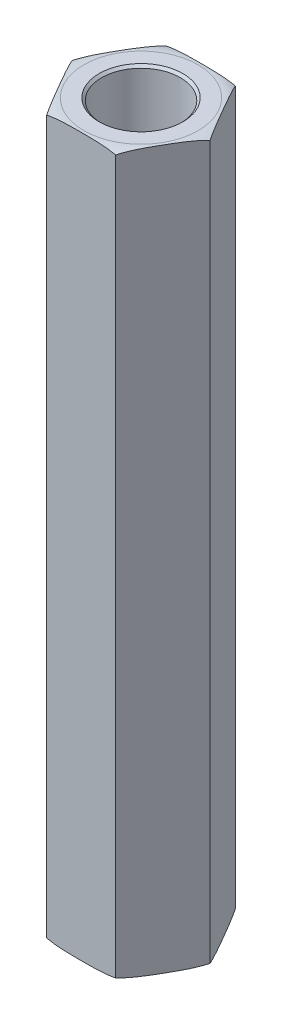
ISO-10303-21;
HEADER;
FILE_DESCRIPTION(('STEP AP214'),'2;1');
FILE_NAME('part.step','',(''),(''),'','','');
FILE_SCHEMA(('AUTOMOTIVE_DESIGN { 1 0 10303 214 1 1 1 1 }'));
ENDSEC;
DATA;
#1=APPLICATION_CONTEXT('core data for automotive mechanical design processes');
#2=APPLICATION_PROTOCOL_DEFINITION('international standard','automotive_design',2000,#1);
#3=PRODUCT_CONTEXT('',#1,'mechanical');
#4=PRODUCT('Part','Part','',(#3));
#5=PRODUCT_RELATED_PRODUCT_CATEGORY('part','',(#4));
#6=PRODUCT_DEFINITION_FORMATION('','',#4);
#7=PRODUCT_DEFINITION_CONTEXT('part definition',#1,'design');
#8=PRODUCT_DEFINITION('design','',#6,#7);
#9=PRODUCT_DEFINITION_SHAPE('','',#8);
#10=(LENGTH_UNIT() NAMED_UNIT(*) SI_UNIT(.MILLI.,.METRE.));
#11=(NAMED_UNIT(*) PLANE_ANGLE_UNIT() SI_UNIT($,.RADIAN.));
#12=(NAMED_UNIT(*) SI_UNIT($,.STERADIAN.) SOLID_ANGLE_UNIT());
#13=UNCERTAINTY_MEASURE_WITH_UNIT(LENGTH_MEASURE(1.E-05),#10,'distance_accuracy_value','');
#14=(GEOMETRIC_REPRESENTATION_CONTEXT(3) GLOBAL_UNCERTAINTY_ASSIGNED_CONTEXT((#13)) GLOBAL_UNIT_ASSIGNED_CONTEXT((#10,
#11,#12)) REPRESENTATION_CONTEXT('',''));
#15=CARTESIAN_POINT('',(0.,0.,0.));
#16=DIRECTION('',(0.,0.,1.));
#17=DIRECTION('',(1.,0.,0.));
#18=AXIS2_PLACEMENT_3D('',#15,#16,#17);
#19=CARTESIAN_POINT('',(0.,6.35,0.));
#20=DIRECTION('',(0.,1.,0.));
#21=DIRECTION('',(0.,0.,1.));
#22=AXIS2_PLACEMENT_3D('',#19,#20,#21);
#23=PLANE('',#22);
#24=CARTESIAN_POINT('',(0.,6.35,0.));
#25=DIRECTION('',(0.,1.,0.));
#26=DIRECTION('',(0.,0.,1.));
#27=AXIS2_PLACEMENT_3D('',#24,#25,#26);
#28=CIRCLE('',#27,2.0955);
#29=CARTESIAN_POINT('',(0.,6.35,2.0955));
#30=VERTEX_POINT('',#29);
#31=EDGE_CURVE('E438',#30,#30,#28,.T.);
#32=ORIENTED_EDGE('',*,*,#31,.T.);
#33=EDGE_LOOP('',(#32));
#34=FACE_BOUND('',#33,.T.);
#35=ADVANCED_FACE('F18',(#34),#23,.T.);
#36=CARTESIAN_POINT('',(0.,-6.35,0.));
#37=DIRECTION('',(0.,-1.,0.));
#38=DIRECTION('',(0.,0.,-1.));
#39=AXIS2_PLACEMENT_3D('',#36,#37,#38);
#40=PLANE('',#39);
#41=CARTESIAN_POINT('',(0.,-6.35,0.));
#42=DIRECTION('',(0.,-1.,0.));
#43=DIRECTION('',(0.,0.,-1.));
#44=AXIS2_PLACEMENT_3D('',#41,#42,#43);
#45=CIRCLE('',#44,2.0955);
#46=CARTESIAN_POINT('',(0.,-6.35,-2.0955));
#47=VERTEX_POINT('',#46);
#48=EDGE_CURVE('E131',#47,#47,#45,.T.);
#49=ORIENTED_EDGE('',*,*,#48,.T.);
#50=EDGE_LOOP('',(#49));
#51=FACE_BOUND('',#50,.T.);
#52=ADVANCED_FACE('F406',(#51),#40,.T.);
#53=CARTESIAN_POINT('',(0.,6.35,0.));
#54=DIRECTION('',(0.,1.,0.));
#55=DIRECTION('',(0.,0.,1.));
#56=AXIS2_PLACEMENT_3D('',#53,#54,#55);
#57=CYLINDRICAL_SURFACE('',#56,2.0955);
#58=CARTESIAN_POINT('',(0.,18.9229999999725,0.));
#59=DIRECTION('',(0.,1.,0.));
#60=DIRECTION('',(0.,0.,1.));
#61=AXIS2_PLACEMENT_3D('',#58,#59,#60);
#62=CIRCLE('',#61,2.09549999999581);
#63=CARTESIAN_POINT('',(0.,18.9229999999725,2.09549999999581));
#64=VERTEX_POINT('',#63);
#65=EDGE_CURVE('E129',#64,#64,#62,.T.);
#66=ORIENTED_EDGE('',*,*,#65,.T.);
#67=EDGE_LOOP('',(#66));
#68=FACE_BOUND('',#67,.T.);
#69=ORIENTED_EDGE('',*,*,#31,.F.);
#70=EDGE_LOOP('',(#69));
#71=FACE_BOUND('',#70,.T.);
#72=ADVANCED_FACE('F397',(#68,#71),#57,.F.);
#73=CARTESIAN_POINT('',(0.,-6.35,0.));
#74=DIRECTION('',(0.,-1.,0.));
#75=DIRECTION('',(0.,0.,-1.));
#76=AXIS2_PLACEMENT_3D('',#73,#74,#75);
#77=CYLINDRICAL_SURFACE('',#76,2.0955);
#78=ORIENTED_EDGE('',*,*,#48,.F.);
#79=EDGE_LOOP('',(#78));
#80=FACE_BOUND('',#79,.T.);
#81=CARTESIAN_POINT('',(0.,-18.9229999999725,0.));
#82=DIRECTION('',(0.,-1.,0.));
#83=DIRECTION('',(0.,0.,-1.));
#84=AXIS2_PLACEMENT_3D('',#81,#82,#83);
#85=CIRCLE('',#84,2.09550000005265);
#86=CARTESIAN_POINT('',(0.,-18.9229999999725,-2.09550000005265));
#87=VERTEX_POINT('',#86);
#88=EDGE_CURVE('E94',#87,#87,#85,.T.);
#89=ORIENTED_EDGE('',*,*,#88,.T.);
#90=EDGE_LOOP('',(#89));
#91=FACE_BOUND('',#90,.T.);
#92=ADVANCED_FACE('F388',(#80,#91),#77,.F.);
#93=CARTESIAN_POINT('',(0.,19.0499999999361,0.));
#94=DIRECTION('',(0.,1.,0.));
#95=DIRECTION('',(0.,0.,1.));
#96=AXIS2_PLACEMENT_3D('',#93,#94,#95);
#97=CONICAL_SURFACE('',#96,2.22249999995938,0.785398163397448);
#98=CARTESIAN_POINT('',(0.,19.0499999999929,0.));
#99=DIRECTION('',(0.,1.,0.));
#100=DIRECTION('',(0.,0.,1.));
#101=AXIS2_PLACEMENT_3D('',#98,#99,#100);
#102=CIRCLE('',#101,2.22250000001623);
#103=CARTESIAN_POINT('',(0.,19.0499999999929,2.22250000001623));
#104=VERTEX_POINT('',#103);
#105=EDGE_CURVE('E206',#104,#104,#102,.T.);
#106=ORIENTED_EDGE('',*,*,#105,.T.);
#107=EDGE_LOOP('',(#106));
#108=FACE_BOUND('',#107,.T.);
#109=ORIENTED_EDGE('',*,*,#65,.F.);
#110=EDGE_LOOP('',(#109));
#111=FACE_BOUND('',#110,.T.);
#112=ADVANCED_FACE('F380',(#108,#111),#97,.F.);
#113=CARTESIAN_POINT('',(0.,-19.0499999999361,0.));
#114=DIRECTION('',(0.,-1.,0.));
#115=DIRECTION('',(0.,0.,-1.));
#116=AXIS2_PLACEMENT_3D('',#113,#114,#115);
#117=CONICAL_SURFACE('',#116,2.22250000001623,0.785398163397448);
#118=ORIENTED_EDGE('',*,*,#88,.F.);
#119=EDGE_LOOP('',(#118));
#120=FACE_BOUND('',#119,.T.);
#121=CARTESIAN_POINT('',(0.,-19.0499999999361,0.));
#122=DIRECTION('',(0.,-1.,0.));
#123=DIRECTION('',(0.,0.,-1.));
#124=AXIS2_PLACEMENT_3D('',#121,#122,#123);
#125=CIRCLE('',#124,2.22250000001623);
#126=CARTESIAN_POINT('',(0.,-19.0499999999361,-2.22250000001623));
#127=VERTEX_POINT('',#126);
#128=EDGE_CURVE('E201',#127,#127,#125,.F.);
#129=ORIENTED_EDGE('',*,*,#128,.F.);
#130=EDGE_LOOP('',(#129));
#131=FACE_BOUND('',#130,.T.);
#132=ADVANCED_FACE('F373',(#120,#131),#117,.F.);
#133=CARTESIAN_POINT('',(1.83308710467706,19.05,3.17499999999999));
#134=DIRECTION('',(-0.866025403784439,0.,-0.5));
#135=DIRECTION('',(-0.5,0.,0.866025403784439));
#136=AXIS2_PLACEMENT_3D('',#133,#134,#135);
#137=PLANE('',#136);
#138=DIRECTION('',(0.,1.,0.));
#139=VECTOR('',#138,1.);
#140=CARTESIAN_POINT('',(3.66617420935412,19.05,0.));
#141=LINE('',#140,#139);
#142=CARTESIAN_POINT('',(3.66617420935412,-18.923,0.));
#143=VERTEX_POINT('',#142);
#144=CARTESIAN_POINT('',(3.66617420935412,18.923,0.));
#145=VERTEX_POINT('',#144);
#146=EDGE_CURVE('E76',#143,#145,#141,.T.);
#147=ORIENTED_EDGE('',*,*,#146,.T.);
#148=CARTESIAN_POINT('',(1.83308710467706,18.923,3.17499999999999));
#149=CARTESIAN_POINT('',(1.87128169935724,18.9389014148997,3.10884502143943));
#150=CARTESIAN_POINT('',(1.90969320538962,18.9524886076105,3.04231434139611));
#151=CARTESIAN_POINT('',(1.98677079607408,18.9758161979402,2.90881203820562));
#152=CARTESIAN_POINT('',(2.02543658353273,18.9855604771397,2.84184092981258));
#153=CARTESIAN_POINT('',(2.10284499535247,19.0019966530451,2.70776562760758));
#154=CARTESIAN_POINT('',(2.14158731769808,19.0086945328669,2.64066195690178));
#155=CARTESIAN_POINT('',(2.21916296783007,19.0197767572932,2.50629698944297));
#156=CARTESIAN_POINT('',(2.2579963181535,19.024160450474,2.43903565365468));
#157=CARTESIAN_POINT('',(2.33572065438806,19.0312403004263,2.30441315431184));
#158=CARTESIAN_POINT('',(2.37461166028646,19.0339355237591,2.23705195613837));
#159=CARTESIAN_POINT('',(2.45240986808529,19.0381531983713,2.10230150749298));
#160=CARTESIAN_POINT('',(2.49131707051153,19.0396756080272,2.03491225611037));
#161=CARTESIAN_POINT('',(2.5687461380425,19.041922705889,1.90080117716405));
#162=CARTESIAN_POINT('',(2.60726795154189,19.0426552468181,1.83407943898342));
#163=CARTESIAN_POINT('',(2.6843135305698,19.0435767302574,1.70063258160851));
#164=CARTESIAN_POINT('',(2.72283729611684,19.0437656658949,1.63390746238215));
#165=CARTESIAN_POINT('',(2.79990166972112,19.0436659966806,1.50042805184608));
#166=CARTESIAN_POINT('',(2.83844227771303,19.0433771811766,1.4336737606495));
#167=CARTESIAN_POINT('',(2.91552223317795,19.042221986219,1.30016736153911));
#168=CARTESIAN_POINT('',(2.9540615806188,19.0413555970386,1.23341525368101));
#169=CARTESIAN_POINT('',(3.03113161773355,19.0387861940656,1.09992603365704));
#170=CARTESIAN_POINT('',(3.06966230777161,19.0370832271617,1.03318892086044));
#171=CARTESIAN_POINT('',(3.14670480062218,19.0324387229726,0.899747408901487));
#172=CARTESIAN_POINT('',(3.18521660427684,19.0294972471358,0.833043008280498));
#173=CARTESIAN_POINT('',(3.24841925163182,19.0232174124749,0.72357281188882));
#174=CARTESIAN_POINT('',(3.27312282066116,19.0203980110463,0.680784975201713));
#175=CARTESIAN_POINT('',(3.32249186130897,19.0138696794304,0.595275288478771));
#176=CARTESIAN_POINT('',(3.34715734368941,19.0101610809139,0.552553419802656));
#177=CARTESIAN_POINT('',(3.39643377591427,19.0016802711497,0.467204135573464));
#178=CARTESIAN_POINT('',(3.42104474295594,18.9969084657008,0.424576690233898));
#179=CARTESIAN_POINT('',(3.47026036719572,18.9860987712516,0.339332728524376));
#180=CARTESIAN_POINT('',(3.49486485317658,18.9800577313084,0.296716508711413));
#181=CARTESIAN_POINT('',(3.54398805502187,18.9665138354161,0.21163262728491));
#182=CARTESIAN_POINT('',(3.56850671785506,18.959010197803,0.169165057524178));
#183=CARTESIAN_POINT('',(3.61743974029948,18.9423203507084,0.0844105764825355));
#184=CARTESIAN_POINT('',(3.64185387349849,18.9331314978033,0.0421240573590955));
#185=CARTESIAN_POINT('',(3.66617420935412,18.923,0.));
#186=B_SPLINE_CURVE_WITH_KNOTS('',3,(#148,#149,#150,#151,#152,#153,#154,#155,#156,#157,#158,
#159,#160,#161,#162,#163,#164,#165,#166,#167,#168,#169,#170,#171,#172,#173,#174,#175,#176,#177,
#178,#179,#180,#181,#182,#183,#184,#185),.UNSPECIFIED.,.F.,.F.,(4,2,2,2,2,2,2,2,2,2,2,2,2,2,2,2,
2,2,4),(0.,0.233977307817955,0.46771767504072,0.700996973557539,0.934341903229802,
1.16781571967246,1.40129782179832,1.63243665809679,1.86357841666627,2.09482211846306,
2.32606971471508,2.55730435147412,2.78852751694429,2.936983692651,3.08538458004484,
3.23372892334592,3.38244598546617,3.53124274626086,3.68027493713584),.UNSPECIFIED.);
#187=CARTESIAN_POINT('',(1.83308710467706,18.923,3.17499999999999));
#188=VERTEX_POINT('',#187);
#189=EDGE_CURVE('E100',#188,#145,#186,.T.);
#190=ORIENTED_EDGE('',*,*,#189,.F.);
#191=DIRECTION('',(0.,1.,0.));
#192=VECTOR('',#191,1.);
#193=CARTESIAN_POINT('',(1.83308710467707,19.05,3.17499999999999));
#194=LINE('',#193,#192);
#195=CARTESIAN_POINT('',(1.83308710467706,-18.923,3.17499999999999));
#196=VERTEX_POINT('',#195);
#197=EDGE_CURVE('E93',#188,#196,#194,.F.);
#198=ORIENTED_EDGE('',*,*,#197,.T.);
#199=CARTESIAN_POINT('',(3.66617420935412,-18.923,0.));
#200=CARTESIAN_POINT('',(3.62797961467394,-18.9389014148997,0.0661549785605664));
#201=CARTESIAN_POINT('',(3.58956810864156,-18.9524886076105,0.132685658603887));
#202=CARTESIAN_POINT('',(3.5124905179571,-18.9758161979402,0.266187961794378));
#203=CARTESIAN_POINT('',(3.47382473049845,-18.9855604771397,0.333159070187413));
#204=CARTESIAN_POINT('',(3.39641631867871,-19.0019966530451,0.467234372392412));
#205=CARTESIAN_POINT('',(3.3576739963331,-19.0086945328669,0.53433804309822));
#206=CARTESIAN_POINT('',(3.28009834620111,-19.0197767572932,0.668703010557026));
#207=CARTESIAN_POINT('',(3.24126499587768,-19.024160450474,0.735964346345317));
#208=CARTESIAN_POINT('',(3.16354065964312,-19.0312403004263,0.870586845688155));
#209=CARTESIAN_POINT('',(3.12464965374472,-19.0339355237591,0.937948043861631));
#210=CARTESIAN_POINT('',(3.04685144594589,-19.0381531983713,1.07269849250702));
#211=CARTESIAN_POINT('',(3.00794424351965,-19.0396756080272,1.14008774388963));
#212=CARTESIAN_POINT('',(2.93051517598868,-19.041922705889,1.27419882283594));
#213=CARTESIAN_POINT('',(2.89199336248929,-19.0426552468181,1.34092056101658));
#214=CARTESIAN_POINT('',(2.81494778346138,-19.0435767302574,1.47436741839149));
#215=CARTESIAN_POINT('',(2.77642401791434,-19.0437656658949,1.54109253761784));
#216=CARTESIAN_POINT('',(2.69935964431006,-19.0436659966806,1.67457194815391));
#217=CARTESIAN_POINT('',(2.66081903631815,-19.0433771811766,1.7413262393505));
#218=CARTESIAN_POINT('',(2.58373908085323,-19.042221986219,1.87483263846089));
#219=CARTESIAN_POINT('',(2.54519973341238,-19.0413555970386,1.94158474631899));
#220=CARTESIAN_POINT('',(2.46812969629763,-19.0387861940656,2.07507396634296));
#221=CARTESIAN_POINT('',(2.42959900625957,-19.0370832271617,2.14181107913956));
#222=CARTESIAN_POINT('',(2.352556513409,-19.0324387229726,2.27525259109851));
#223=CARTESIAN_POINT('',(2.31404470975434,-19.0294972471358,2.3419569917195));
#224=CARTESIAN_POINT('',(2.25084206239936,-19.0232174124749,2.45142718811118));
#225=CARTESIAN_POINT('',(2.22613849337002,-19.0203980110463,2.49421502479828));
#226=CARTESIAN_POINT('',(2.17676945272221,-19.0138696794304,2.57972471152123));
#227=CARTESIAN_POINT('',(2.15210397034177,-19.0101610809139,2.62244658019734));
#228=CARTESIAN_POINT('',(2.10282753811691,-19.0016802711497,2.70779586442653));
#229=CARTESIAN_POINT('',(2.07821657107524,-18.9969084657008,2.7504233097661));
#230=CARTESIAN_POINT('',(2.02900094683546,-18.9860987712516,2.83566727147562));
#231=CARTESIAN_POINT('',(2.0043964608546,-18.9800577313084,2.87828349128858));
#232=CARTESIAN_POINT('',(1.95527325900931,-18.9665138354161,2.96336737271509));
#233=CARTESIAN_POINT('',(1.93075459617612,-18.959010197803,3.00583494247582));
#234=CARTESIAN_POINT('',(1.88182157373171,-18.9423203507084,3.09058942351746));
#235=CARTESIAN_POINT('',(1.8574074405327,-18.9331314978033,3.1328759426409));
#236=CARTESIAN_POINT('',(1.83308710467706,-18.923,3.17499999999999));
#237=B_SPLINE_CURVE_WITH_KNOTS('',3,(#199,#200,#201,#202,#203,#204,#205,#206,#207,#208,#209,
#210,#211,#212,#213,#214,#215,#216,#217,#218,#219,#220,#221,#222,#223,#224,#225,#226,#227,#228,
#229,#230,#231,#232,#233,#234,#235,#236),.UNSPECIFIED.,.F.,.F.,(4,2,2,2,2,2,2,2,2,2,2,2,2,2,2,2,
2,2,4),(0.,0.233977307817955,0.46771767504072,0.70099697355754,0.934341903229803,
1.16781571967246,1.40129782179833,1.63243665809679,1.86357841666628,2.09482211846306,
2.32606971471508,2.55730435147412,2.78852751694429,2.93698369265101,3.08538458004484,
3.23372892334592,3.38244598546617,3.53124274626086,3.68027493713584),.UNSPECIFIED.);
#238=EDGE_CURVE('E87',#143,#196,#237,.T.);
#239=ORIENTED_EDGE('',*,*,#238,.F.);
#240=EDGE_LOOP('',(#147,#190,#198,#239));
#241=FACE_BOUND('',#240,.T.);
#242=ADVANCED_FACE('F91',(#241),#137,.F.);
#243=CARTESIAN_POINT('',(3.66617420935412,19.05,0.));
#244=DIRECTION('',(-0.866025403784439,0.,0.5));
#245=DIRECTION('',(0.5,0.,0.866025403784439));
#246=AXIS2_PLACEMENT_3D('',#243,#244,#245);
#247=PLANE('',#246);
#248=DIRECTION('',(0.,1.,0.));
#249=VECTOR('',#248,1.);
#250=CARTESIAN_POINT('',(1.83308710467706,19.05,-3.175));
#251=LINE('',#250,#249);
#252=CARTESIAN_POINT('',(1.83308710467706,-18.923,-3.175));
#253=VERTEX_POINT('',#252);
#254=CARTESIAN_POINT('',(1.83308710467705,18.923,-3.175));
#255=VERTEX_POINT('',#254);
#256=EDGE_CURVE('E165',#253,#255,#251,.T.);
#257=ORIENTED_EDGE('',*,*,#256,.T.);
#258=CARTESIAN_POINT('',(3.66617420935412,18.923,0.));
#259=CARTESIAN_POINT('',(3.62797961467394,18.9389014148997,-0.0661549785605604));
#260=CARTESIAN_POINT('',(3.58956810864156,18.9524886076105,-0.132685658603881));
#261=CARTESIAN_POINT('',(3.5124905179571,18.9758161979402,-0.266187961794372));
#262=CARTESIAN_POINT('',(3.47382473049845,18.9855604771397,-0.333159070187407));
#263=CARTESIAN_POINT('',(3.39641631867872,19.0019966530451,-0.467234372392405));
#264=CARTESIAN_POINT('',(3.35767399633311,19.0086945328669,-0.534338043098212));
#265=CARTESIAN_POINT('',(3.28009834620111,19.0197767572932,-0.668703010557018));
#266=CARTESIAN_POINT('',(3.24126499587769,19.024160450474,-0.735964346345308));
#267=CARTESIAN_POINT('',(3.16354065964312,19.0312403004263,-0.870586845688146));
#268=CARTESIAN_POINT('',(3.12464965374473,19.0339355237591,-0.937948043861621));
#269=CARTESIAN_POINT('',(3.04685144594589,19.0381531983713,-1.07269849250701));
#270=CARTESIAN_POINT('',(3.00794424351965,19.0396756080272,-1.14008774388962));
#271=CARTESIAN_POINT('',(2.93051517598869,19.041922705889,-1.27419882283593));
#272=CARTESIAN_POINT('',(2.8919933624893,19.0426552468181,-1.34092056101657));
#273=CARTESIAN_POINT('',(2.81494778346139,19.0435767302574,-1.47436741839148));
#274=CARTESIAN_POINT('',(2.77642401791434,19.0437656658949,-1.54109253761783));
#275=CARTESIAN_POINT('',(2.69935964431007,19.0436659966806,-1.6745719481539));
#276=CARTESIAN_POINT('',(2.66081903631816,19.0433771811766,-1.74132623935049));
#277=CARTESIAN_POINT('',(2.58373908085323,19.042221986219,-1.87483263846088));
#278=CARTESIAN_POINT('',(2.54519973341239,19.0413555970386,-1.94158474631897));
#279=CARTESIAN_POINT('',(2.46812969629764,19.0387861940656,-2.07507396634294));
#280=CARTESIAN_POINT('',(2.42959900625958,19.0370832271617,-2.14181107913955));
#281=CARTESIAN_POINT('',(2.35255651340901,19.0324387229726,-2.27525259109849));
#282=CARTESIAN_POINT('',(2.31404470975435,19.0294972471358,-2.34195699171948));
#283=CARTESIAN_POINT('',(2.25084206239937,19.0232174124749,-2.45142718811116));
#284=CARTESIAN_POINT('',(2.22613849337003,19.0203980110463,-2.49421502479827));
#285=CARTESIAN_POINT('',(2.17676945272222,19.0138696794304,-2.57972471152122));
#286=CARTESIAN_POINT('',(2.15210397034178,19.0101610809139,-2.62244658019733));
#287=CARTESIAN_POINT('',(2.10282753811691,19.0016802711497,-2.70779586442653));
#288=CARTESIAN_POINT('',(2.07821657107524,18.9969084657008,-2.75042330976609));
#289=CARTESIAN_POINT('',(2.02900094683546,18.9860987712516,-2.83566727147562));
#290=CARTESIAN_POINT('',(2.0043964608546,18.9800577313084,-2.87828349128858));
#291=CARTESIAN_POINT('',(1.95527325900931,18.9665138354161,-2.96336737271509));
#292=CARTESIAN_POINT('',(1.93075459617612,18.959010197803,-3.00583494247582));
#293=CARTESIAN_POINT('',(1.8818215737317,18.9423203507084,-3.09058942351747));
#294=CARTESIAN_POINT('',(1.85740744053269,18.9331314978033,-3.13287594264091));
#295=CARTESIAN_POINT('',(1.83308710467705,18.923,-3.175));
#296=B_SPLINE_CURVE_WITH_KNOTS('',3,(#258,#259,#260,#261,#262,#263,#264,#265,#266,#267,#268,
#269,#270,#271,#272,#273,#274,#275,#276,#277,#278,#279,#280,#281,#282,#283,#284,#285,#286,#287,
#288,#289,#290,#291,#292,#293,#294,#295),.UNSPECIFIED.,.F.,.F.,(4,2,2,2,2,2,2,2,2,2,2,2,2,2,2,2,
2,2,4),(0.,0.233977307817954,0.467717675040719,0.700996973557537,0.934341903229799,
1.16781571967246,1.40129782179832,1.63243665809678,1.86357841666627,2.09482211846305,
2.32606971471507,2.55730435147411,2.78852751694428,2.936983692651,3.08538458004484,
3.23372892334592,3.38244598546618,3.53124274626087,3.68027493713586),.UNSPECIFIED.);
#297=EDGE_CURVE('E84',#145,#255,#296,.T.);
#298=ORIENTED_EDGE('',*,*,#297,.F.);
#299=ORIENTED_EDGE('',*,*,#146,.F.);
#300=CARTESIAN_POINT('',(1.83308710467706,-18.923,-3.175));
#301=CARTESIAN_POINT('',(1.87128169935723,-18.9389014148997,-3.10884502143944));
#302=CARTESIAN_POINT('',(1.90969320538961,-18.9524886076105,-3.04231434139612));
#303=CARTESIAN_POINT('',(1.98677079607408,-18.9758161979402,-2.90881203820563));
#304=CARTESIAN_POINT('',(2.02543658353272,-18.9855604771397,-2.84184092981259));
#305=CARTESIAN_POINT('',(2.10284499535246,-19.0019966530451,-2.70776562760759));
#306=CARTESIAN_POINT('',(2.14158731769807,-19.0086945328669,-2.64066195690179));
#307=CARTESIAN_POINT('',(2.21916296783006,-19.0197767572932,-2.50629698944298));
#308=CARTESIAN_POINT('',(2.25799631815349,-19.024160450474,-2.43903565365469));
#309=CARTESIAN_POINT('',(2.33572065438805,-19.0312403004263,-2.30441315431186));
#310=CARTESIAN_POINT('',(2.37461166028645,-19.0339355237591,-2.23705195613838));
#311=CARTESIAN_POINT('',(2.45240986808528,-19.0381531983713,-2.102301507493));
#312=CARTESIAN_POINT('',(2.49131707051152,-19.0396756080272,-2.03491225611039));
#313=CARTESIAN_POINT('',(2.56874613804248,-19.041922705889,-1.90080117716407));
#314=CARTESIAN_POINT('',(2.60726795154187,-19.0426552468181,-1.83407943898344));
#315=CARTESIAN_POINT('',(2.68431353056979,-19.0435767302574,-1.70063258160853));
#316=CARTESIAN_POINT('',(2.72283729611683,-19.0437656658949,-1.63390746238217));
#317=CARTESIAN_POINT('',(2.7999016697211,-19.0436659966806,-1.50042805184611));
#318=CARTESIAN_POINT('',(2.83844227771302,-19.0433771811766,-1.43367376064952));
#319=CARTESIAN_POINT('',(2.91552223317794,-19.042221986219,-1.30016736153913));
#320=CARTESIAN_POINT('',(2.95406158061878,-19.0413555970386,-1.23341525368103));
#321=CARTESIAN_POINT('',(3.03113161773353,-19.0387861940656,-1.09992603365707));
#322=CARTESIAN_POINT('',(3.06966230777159,-19.0370832271617,-1.03318892086046));
#323=CARTESIAN_POINT('',(3.14670480062216,-19.0324387229726,-0.899747408901513));
#324=CARTESIAN_POINT('',(3.18521660427682,-19.0294972471358,-0.833043008280524));
#325=CARTESIAN_POINT('',(3.2484192516318,-19.0232174124749,-0.723572811888844));
#326=CARTESIAN_POINT('',(3.27312282066114,-19.0203980110463,-0.680784975201736));
#327=CARTESIAN_POINT('',(3.32249186130896,-19.0138696794304,-0.59527528847879));
#328=CARTESIAN_POINT('',(3.3471573436894,-19.0101610809139,-0.552553419802673));
#329=CARTESIAN_POINT('',(3.39643377591426,-19.0016802711497,-0.467204135573478));
#330=CARTESIAN_POINT('',(3.42104474295593,-18.9969084657008,-0.42457669023391));
#331=CARTESIAN_POINT('',(3.47026036719571,-18.9860987712516,-0.339332728524384));
#332=CARTESIAN_POINT('',(3.49486485317657,-18.9800577313084,-0.29671650871142));
#333=CARTESIAN_POINT('',(3.54398805502186,-18.9665138354161,-0.211632627284913));
#334=CARTESIAN_POINT('',(3.56850671785505,-18.959010197803,-0.169165057524178));
#335=CARTESIAN_POINT('',(3.61743974029948,-18.9423203507084,-0.0844105764825321));
#336=CARTESIAN_POINT('',(3.64185387349849,-18.9331314978033,-0.0421240573590899));
#337=CARTESIAN_POINT('',(3.66617420935412,-18.923,0.));
#338=B_SPLINE_CURVE_WITH_KNOTS('',3,(#300,#301,#302,#303,#304,#305,#306,#307,#308,#309,#310,
#311,#312,#313,#314,#315,#316,#317,#318,#319,#320,#321,#322,#323,#324,#325,#326,#327,#328,#329,
#330,#331,#332,#333,#334,#335,#336,#337),.UNSPECIFIED.,.F.,.F.,(4,2,2,2,2,2,2,2,2,2,2,2,2,2,2,2,
2,2,4),(0.,0.233977307817952,0.467717675040715,0.700996973557533,0.934341903229794,
1.16781571967245,1.40129782179831,1.63243665809677,1.86357841666626,2.09482211846304,
2.32606971471506,2.5573043514741,2.78852751694426,2.93698369265099,3.08538458004483,
3.23372892334591,3.38244598546617,3.53124274626087,3.68027493713585),.UNSPECIFIED.);
#339=EDGE_CURVE('E81',#253,#143,#338,.T.);
#340=ORIENTED_EDGE('',*,*,#339,.F.);
#341=EDGE_LOOP('',(#257,#298,#299,#340));
#342=FACE_BOUND('',#341,.T.);
#343=ADVANCED_FACE('F79',(#342),#247,.F.);
#344=CARTESIAN_POINT('',(-1.83308710467707,19.05,-3.175));
#345=DIRECTION('',(0.,-1.,0.));
#346=DIRECTION('',(0.,0.,-1.));
#347=AXIS2_PLACEMENT_3D('',#344,#345,#346);
#348=PLANE('',#347);
#349=CARTESIAN_POINT('',(0.,19.05,0.));
#350=DIRECTION('',(0.,-1.,0.));
#351=DIRECTION('',(0.,0.,1.));
#352=AXIS2_PLACEMENT_3D('',#349,#350,#351);
#353=CIRCLE('',#352,3.03117420935412);
#354=CARTESIAN_POINT('',(0.,19.05,3.03117420935412));
#355=VERTEX_POINT('',#354);
#356=CARTESIAN_POINT('',(0.,19.05,-3.03117420935412));
#357=VERTEX_POINT('',#356);
#358=EDGE_CURVE('E242',#355,#357,#353,.T.);
#359=ORIENTED_EDGE('',*,*,#358,.F.);
#360=CARTESIAN_POINT('',(0.,19.05,0.));
#361=DIRECTION('',(0.,-1.,0.));
#362=DIRECTION('',(0.,0.,-1.));
#363=AXIS2_PLACEMENT_3D('',#360,#361,#362);
#364=CIRCLE('',#363,3.03117420935412);
#365=EDGE_CURVE('E205',#357,#355,#364,.T.);
#366=ORIENTED_EDGE('',*,*,#365,.F.);
#367=EDGE_LOOP('',(#359,#366));
#368=FACE_BOUND('',#367,.T.);
#369=ORIENTED_EDGE('',*,*,#105,.F.);
#370=EDGE_LOOP('',(#369));
#371=FACE_BOUND('',#370,.T.);
#372=ADVANCED_FACE('F213',(#368,#371),#348,.F.);
#373=CARTESIAN_POINT('',(-1.83308710467707,-19.05,-3.175));
#374=DIRECTION('',(0.,-1.,0.));
#375=DIRECTION('',(0.,0.,-1.));
#376=AXIS2_PLACEMENT_3D('',#373,#374,#375);
#377=PLANE('',#376);
#378=CARTESIAN_POINT('',(0.,-19.05,0.));
#379=DIRECTION('',(0.,1.,0.));
#380=DIRECTION('',(0.,0.,1.));
#381=AXIS2_PLACEMENT_3D('',#378,#379,#380);
#382=CIRCLE('',#381,3.03117420935412);
#383=CARTESIAN_POINT('',(0.,-19.05,-3.03117420935412));
#384=VERTEX_POINT('',#383);
#385=CARTESIAN_POINT('',(0.,-19.05,3.03117420935412));
#386=VERTEX_POINT('',#385);
#387=EDGE_CURVE('E204',#384,#386,#382,.F.);
#388=ORIENTED_EDGE('',*,*,#387,.T.);
#389=CARTESIAN_POINT('',(0.,-19.05,0.));
#390=DIRECTION('',(0.,1.,0.));
#391=DIRECTION('',(0.,0.,-1.));
#392=AXIS2_PLACEMENT_3D('',#389,#390,#391);
#393=CIRCLE('',#392,3.03117420935412);
#394=EDGE_CURVE('E269',#384,#386,#393,.T.);
#395=ORIENTED_EDGE('',*,*,#394,.F.);
#396=EDGE_LOOP('',(#388,#395));
#397=FACE_BOUND('',#396,.T.);
#398=ORIENTED_EDGE('',*,*,#128,.T.);
#399=EDGE_LOOP('',(#398));
#400=FACE_BOUND('',#399,.T.);
#401=ADVANCED_FACE('F219',(#397,#400),#377,.T.);
#402=CARTESIAN_POINT('',(-1.83308710467707,19.05,3.175));
#403=DIRECTION('',(0.,0.,-1.));
#404=DIRECTION('',(-1.,0.,0.));
#405=AXIS2_PLACEMENT_3D('',#402,#403,#404);
#406=PLANE('',#405);
#407=ORIENTED_EDGE('',*,*,#197,.F.);
#408=CARTESIAN_POINT('',(-1.83308710467706,18.923,3.175));
#409=CARTESIAN_POINT('',(-1.73237579828683,18.9439400141518,3.175));
#410=CARTESIAN_POINT('',(-1.63096506893486,18.9608853495327,3.175));
#411=CARTESIAN_POINT('',(-1.42767146651469,18.9884971643984,3.175));
#412=CARTESIAN_POINT('',(-1.32579191427254,18.9991875658753,3.175));
#413=CARTESIAN_POINT('',(-1.12177634709138,19.0161280408079,3.175));
#414=CARTESIAN_POINT('',(-1.0196405664338,19.0223812707189,3.175));
#415=CARTESIAN_POINT('',(-0.815663681397376,19.0319028064183,3.175));
#416=CARTESIAN_POINT('',(-0.713823115514574,19.0351834044999,3.175));
#417=CARTESIAN_POINT('',(-0.510018485441651,19.0399454848703,3.175));
#418=CARTESIAN_POINT('',(-0.408054390577977,19.0414254100882,3.175));
#419=CARTESIAN_POINT('',(-0.20406020033787,19.0433146818379,3.175));
#420=CARTESIAN_POINT('',(-0.102030100168935,19.0437234241492,3.175));
#421=CARTESIAN_POINT('',(0.102030100168936,19.0437234241492,3.175));
#422=CARTESIAN_POINT('',(0.204060200337871,19.0433146818379,3.17499999999999));
#423=CARTESIAN_POINT('',(0.408054390577978,19.0414254100882,3.17499999999999));
#424=CARTESIAN_POINT('',(0.510018485441653,19.0399454848703,3.17499999999999));
#425=CARTESIAN_POINT('',(0.713823115514576,19.0351834044999,3.17499999999999));
#426=CARTESIAN_POINT('',(0.815663681397379,19.0319028064183,3.17499999999999));
#427=CARTESIAN_POINT('',(1.0196405664338,19.0223812707189,3.17499999999999));
#428=CARTESIAN_POINT('',(1.12177634709138,19.0161280408079,3.17499999999999));
#429=CARTESIAN_POINT('',(1.32579191427255,18.9991875658753,3.17499999999999));
#430=CARTESIAN_POINT('',(1.4276714665147,18.9884971643984,3.17499999999999));
#431=CARTESIAN_POINT('',(1.63096506893487,18.9608853495327,3.17499999999999));
#432=CARTESIAN_POINT('',(1.73237579828684,18.9439400141518,3.17499999999999));
#433=CARTESIAN_POINT('',(1.83308710467707,18.923,3.17499999999999));
#434=B_SPLINE_CURVE_WITH_KNOTS('',3,(#408,#409,#410,#411,#412,#413,#414,#415,#416,#417,#418,
#419,#420,#421,#422,#423,#424,#425,#426,#427,#428,#429,#430,#431,#432,#433),.UNSPECIFIED.,.F.,
.F.,(4,2,2,2,2,2,2,2,2,2,2,2,4),(0.,0.308333242342808,0.615479423308235,0.92240689113001,
1.2280592962085,1.53397581645216,1.84006485747889,2.14615389850562,2.45207041874928,
2.75772282382777,3.06465029164955,3.37179647261498,3.68012971495778),.UNSPECIFIED.);
#435=CARTESIAN_POINT('',(-1.83308710467706,18.923,3.175));
#436=VERTEX_POINT('',#435);
#437=EDGE_CURVE('E191',#436,#188,#434,.T.);
#438=ORIENTED_EDGE('',*,*,#437,.F.);
#439=DIRECTION('',(0.,1.,0.));
#440=VECTOR('',#439,1.);
#441=CARTESIAN_POINT('',(-1.83308710467707,19.05,3.175));
#442=LINE('',#441,#440);
#443=CARTESIAN_POINT('',(-1.83308710467708,-18.923,3.17499999999999));
#444=VERTEX_POINT('',#443);
#445=EDGE_CURVE('E159',#436,#444,#442,.F.);
#446=ORIENTED_EDGE('',*,*,#445,.T.);
#447=CARTESIAN_POINT('',(1.83308710467706,-18.923,3.17499999999999));
#448=CARTESIAN_POINT('',(1.73237579828684,-18.9439400141518,3.17499999999999));
#449=CARTESIAN_POINT('',(1.63096506893486,-18.9608853495327,3.17499999999999));
#450=CARTESIAN_POINT('',(1.4276714665147,-18.9884971643984,3.17499999999999));
#451=CARTESIAN_POINT('',(1.32579191427254,-18.9991875658753,3.17499999999999));
#452=CARTESIAN_POINT('',(1.12177634709138,-19.0161280408079,3.17499999999999));
#453=CARTESIAN_POINT('',(1.0196405664338,-19.0223812707189,3.17499999999999));
#454=CARTESIAN_POINT('',(0.815663681397379,-19.0319028064183,3.17499999999999));
#455=CARTESIAN_POINT('',(0.713823115514576,-19.0351834044999,3.17499999999999));
#456=CARTESIAN_POINT('',(0.510018485441653,-19.0399454848703,3.17499999999999));
#457=CARTESIAN_POINT('',(0.408054390577978,-19.0414254100882,3.17499999999999));
#458=CARTESIAN_POINT('',(0.204060200337871,-19.0433146818379,3.17499999999999));
#459=CARTESIAN_POINT('',(0.102030100168935,-19.0437234241492,3.175));
#460=CARTESIAN_POINT('',(-0.102030100168936,-19.0437234241492,3.175));
#461=CARTESIAN_POINT('',(-0.204060200337872,-19.0433146818379,3.175));
#462=CARTESIAN_POINT('',(-0.408054390577981,-19.0414254100882,3.175));
#463=CARTESIAN_POINT('',(-0.510018485441656,-19.0399454848703,3.175));
#464=CARTESIAN_POINT('',(-0.713823115514581,-19.0351834044999,3.175));
#465=CARTESIAN_POINT('',(-0.815663681397384,-19.0319028064183,3.175));
#466=CARTESIAN_POINT('',(-1.01964056643381,-19.0223812707189,3.175));
#467=CARTESIAN_POINT('',(-1.12177634709139,-19.0161280408079,3.175));
#468=CARTESIAN_POINT('',(-1.32579191427255,-18.9991875658753,3.175));
#469=CARTESIAN_POINT('',(-1.42767146651471,-18.9884971643984,3.175));
#470=CARTESIAN_POINT('',(-1.63096506893487,-18.9608853495327,3.175));
#471=CARTESIAN_POINT('',(-1.73237579828685,-18.9439400141518,3.175));
#472=CARTESIAN_POINT('',(-1.83308710467708,-18.923,3.175));
#473=B_SPLINE_CURVE_WITH_KNOTS('',3,(#447,#448,#449,#450,#451,#452,#453,#454,#455,#456,#457,
#458,#459,#460,#461,#462,#463,#464,#465,#466,#467,#468,#469,#470,#471,#472),.UNSPECIFIED.,.F.,
.F.,(4,2,2,2,2,2,2,2,2,2,2,2,4),(0.,0.308333242342808,0.615479423308237,0.922406891130012,
1.22805929620851,1.53397581645217,1.84006485747889,2.14615389850562,2.45207041874929,
2.75772282382778,3.06465029164956,3.37179647261499,3.6801297149578),.UNSPECIFIED.);
#474=EDGE_CURVE('E252',#196,#444,#473,.T.);
#475=ORIENTED_EDGE('',*,*,#474,.F.);
#476=EDGE_LOOP('',(#407,#438,#446,#475));
#477=FACE_BOUND('',#476,.T.);
#478=ADVANCED_FACE('F251',(#477),#406,.F.);
#479=CARTESIAN_POINT('',(1.83308710467706,19.05,-3.175));
#480=DIRECTION('',(0.,0.,1.));
#481=DIRECTION('',(1.,0.,0.));
#482=AXIS2_PLACEMENT_3D('',#479,#480,#481);
#483=PLANE('',#482);
#484=DIRECTION('',(0.,1.,0.));
#485=VECTOR('',#484,1.);
#486=CARTESIAN_POINT('',(-1.83308710467708,19.05,-3.17499999999999));
#487=LINE('',#486,#485);
#488=CARTESIAN_POINT('',(-1.83308710467708,-18.923,-3.175));
#489=VERTEX_POINT('',#488);
#490=CARTESIAN_POINT('',(-1.83308710467706,18.923,-3.17500000000001));
#491=VERTEX_POINT('',#490);
#492=EDGE_CURVE('E157',#489,#491,#487,.T.);
#493=ORIENTED_EDGE('',*,*,#492,.T.);
#494=CARTESIAN_POINT('',(1.83308710467705,18.923,-3.175));
#495=CARTESIAN_POINT('',(1.73237579828683,18.9439400141518,-3.175));
#496=CARTESIAN_POINT('',(1.63096506893486,18.9608853495327,-3.175));
#497=CARTESIAN_POINT('',(1.42767146651469,18.9884971643984,-3.175));
#498=CARTESIAN_POINT('',(1.32579191427254,18.9991875658753,-3.175));
#499=CARTESIAN_POINT('',(1.12177634709137,19.0161280408079,-3.175));
#500=CARTESIAN_POINT('',(1.01964056643379,19.0223812707189,-3.175));
#501=CARTESIAN_POINT('',(0.815663681397374,19.0319028064183,-3.175));
#502=CARTESIAN_POINT('',(0.713823115514572,19.0351834044999,-3.175));
#503=CARTESIAN_POINT('',(0.51001848544165,19.0399454848703,-3.175));
#504=CARTESIAN_POINT('',(0.408054390577976,19.0414254100882,-3.175));
#505=CARTESIAN_POINT('',(0.20406020033787,19.0433146818379,-3.175));
#506=CARTESIAN_POINT('',(0.102030100168935,19.0437234241492,-3.175));
#507=CARTESIAN_POINT('',(-0.102030100168934,19.0437234241492,-3.175));
#508=CARTESIAN_POINT('',(-0.204060200337869,19.0433146818379,-3.175));
#509=CARTESIAN_POINT('',(-0.408054390577975,19.0414254100882,-3.175));
#510=CARTESIAN_POINT('',(-0.510018485441649,19.0399454848703,-3.175));
#511=CARTESIAN_POINT('',(-0.71382311551457,19.0351834044999,-3.175));
#512=CARTESIAN_POINT('',(-0.815663681397373,19.0319028064183,-3.175));
#513=CARTESIAN_POINT('',(-1.01964056643379,19.0223812707189,-3.175));
#514=CARTESIAN_POINT('',(-1.12177634709137,19.0161280408079,-3.175));
#515=CARTESIAN_POINT('',(-1.32579191427254,18.9991875658753,-3.175));
#516=CARTESIAN_POINT('',(-1.42767146651469,18.9884971643984,-3.175));
#517=CARTESIAN_POINT('',(-1.63096506893485,18.9608853495327,-3.175));
#518=CARTESIAN_POINT('',(-1.73237579828683,18.9439400141518,-3.175));
#519=CARTESIAN_POINT('',(-1.83308710467705,18.923,-3.175));
#520=B_SPLINE_CURVE_WITH_KNOTS('',3,(#494,#495,#496,#497,#498,#499,#500,#501,#502,#503,#504,
#505,#506,#507,#508,#509,#510,#511,#512,#513,#514,#515,#516,#517,#518,#519),.UNSPECIFIED.,.F.,
.F.,(4,2,2,2,2,2,2,2,2,2,2,2,4),(0.,0.308333242342807,0.615479423308234,0.922406891130008,
1.2280592962085,1.53397581645216,1.84006485747888,2.14615389850561,2.45207041874927,
2.75772282382776,3.06465029164953,3.37179647261496,3.68012971495777),.UNSPECIFIED.);
#521=EDGE_CURVE('E196',#255,#491,#520,.T.);
#522=ORIENTED_EDGE('',*,*,#521,.F.);
#523=ORIENTED_EDGE('',*,*,#256,.F.);
#524=CARTESIAN_POINT('',(-1.83308710467708,-18.923,-3.17500000000001));
#525=CARTESIAN_POINT('',(-1.73237579828685,-18.9439400141518,-3.175));
#526=CARTESIAN_POINT('',(-1.63096506893487,-18.9608853495327,-3.175));
#527=CARTESIAN_POINT('',(-1.4276714665147,-18.9884971643984,-3.175));
#528=CARTESIAN_POINT('',(-1.32579191427255,-18.9991875658753,-3.175));
#529=CARTESIAN_POINT('',(-1.12177634709139,-19.0161280408079,-3.175));
#530=CARTESIAN_POINT('',(-1.01964056643381,-19.0223812707189,-3.175));
#531=CARTESIAN_POINT('',(-0.815663681397384,-19.0319028064183,-3.175));
#532=CARTESIAN_POINT('',(-0.71382311551458,-19.0351834044999,-3.175));
#533=CARTESIAN_POINT('',(-0.510018485441656,-19.0399454848703,-3.175));
#534=CARTESIAN_POINT('',(-0.408054390577981,-19.0414254100882,-3.175));
#535=CARTESIAN_POINT('',(-0.204060200337873,-19.0433146818379,-3.175));
#536=CARTESIAN_POINT('',(-0.102030100168937,-19.0437234241492,-3.175));
#537=CARTESIAN_POINT('',(0.102030100168935,-19.0437234241492,-3.175));
#538=CARTESIAN_POINT('',(0.20406020033787,-19.0433146818379,-3.175));
#539=CARTESIAN_POINT('',(0.408054390577977,-19.0414254100882,-3.175));
#540=CARTESIAN_POINT('',(0.510018485441651,-19.0399454848703,-3.175));
#541=CARTESIAN_POINT('',(0.713823115514573,-19.0351834044999,-3.175));
#542=CARTESIAN_POINT('',(0.815663681397376,-19.0319028064183,-3.175));
#543=CARTESIAN_POINT('',(1.0196405664338,-19.0223812707189,-3.175));
#544=CARTESIAN_POINT('',(1.12177634709138,-19.0161280408079,-3.175));
#545=CARTESIAN_POINT('',(1.32579191427254,-18.9991875658753,-3.175));
#546=CARTESIAN_POINT('',(1.42767146651469,-18.9884971643984,-3.175));
#547=CARTESIAN_POINT('',(1.63096506893486,-18.9608853495327,-3.175));
#548=CARTESIAN_POINT('',(1.73237579828683,-18.9439400141518,-3.175));
#549=CARTESIAN_POINT('',(1.83308710467706,-18.923,-3.17500000000001));
#550=B_SPLINE_CURVE_WITH_KNOTS('',3,(#524,#525,#526,#527,#528,#529,#530,#531,#532,#533,#534,
#535,#536,#537,#538,#539,#540,#541,#542,#543,#544,#545,#546,#547,#548,#549),.UNSPECIFIED.,.F.,
.F.,(4,2,2,2,2,2,2,2,2,2,2,2,4),(0.,0.30833324234281,0.615479423308241,0.922406891130018,
1.22805929620851,1.53397581645217,1.84006485747891,2.14615389850563,2.45207041874929,
2.75772282382779,3.06465029164956,3.37179647261499,3.6801297149578),.UNSPECIFIED.);
#551=EDGE_CURVE('E99',#489,#253,#550,.T.);
#552=ORIENTED_EDGE('',*,*,#551,.F.);
#553=EDGE_LOOP('',(#493,#522,#523,#552));
#554=FACE_BOUND('',#553,.T.);
#555=ADVANCED_FACE('F171',(#554),#483,.F.);
#556=CARTESIAN_POINT('',(0.,17.399,0.));
#557=DIRECTION('',(0.,1.,0.));
#558=DIRECTION('',(0.,0.,1.));
#559=AXIS2_PLACEMENT_3D('',#556,#557,#558);
#560=TOROIDAL_SURFACE('',#559,3.03117420935412,1.65100000000002);
#561=ORIENTED_EDGE('',*,*,#358,.T.);
#562=ORIENTED_EDGE('',*,*,#365,.T.);
#563=EDGE_LOOP('',(#561,#562));
#564=FACE_BOUND('',#563,.T.);
#565=ORIENTED_EDGE('',*,*,#437,.T.);
#566=ORIENTED_EDGE('',*,*,#189,.T.);
#567=ORIENTED_EDGE('',*,*,#297,.T.);
#568=ORIENTED_EDGE('',*,*,#521,.T.);
#569=CARTESIAN_POINT('',(-1.83308710467706,18.923,-3.17500000000001));
#570=CARTESIAN_POINT('',(-1.87128169935724,18.9389014148997,-3.10884502143945));
#571=CARTESIAN_POINT('',(-1.90969320538962,18.9524886076105,-3.04231434139613));
#572=CARTESIAN_POINT('',(-1.98677079607408,18.9758161979402,-2.90881203820564));
#573=CARTESIAN_POINT('',(-2.02543658353272,18.9855604771397,-2.84184092981261));
#574=CARTESIAN_POINT('',(-2.10284499535246,19.0019966530451,-2.70776562760761));
#575=CARTESIAN_POINT('',(-2.14158731769807,19.0086945328669,-2.64066195690181));
#576=CARTESIAN_POINT('',(-2.21916296783006,19.0197767572932,-2.50629698944301));
#577=CARTESIAN_POINT('',(-2.25799631815348,19.024160450474,-2.43903565365472));
#578=CARTESIAN_POINT('',(-2.33572065438805,19.0312403004263,-2.30441315431188));
#579=CARTESIAN_POINT('',(-2.37461166028644,19.0339355237591,-2.23705195613841));
#580=CARTESIAN_POINT('',(-2.45240986808527,19.0381531983713,-2.10230150749303));
#581=CARTESIAN_POINT('',(-2.49131707051151,19.0396756080272,-2.03491225611042));
#582=CARTESIAN_POINT('',(-2.56874613804247,19.041922705889,-1.90080117716411));
#583=CARTESIAN_POINT('',(-2.60726795154186,19.0426552468181,-1.83407943898348));
#584=CARTESIAN_POINT('',(-2.68431353056977,19.0435767302574,-1.70063258160857));
#585=CARTESIAN_POINT('',(-2.72283729611682,19.0437656658949,-1.63390746238222));
#586=CARTESIAN_POINT('',(-2.79990166972109,19.0436659966806,-1.50042805184615));
#587=CARTESIAN_POINT('',(-2.838442277713,19.0433771811766,-1.43367376064956));
#588=CARTESIAN_POINT('',(-2.91552223317792,19.042221986219,-1.30016736153918));
#589=CARTESIAN_POINT('',(-2.95406158061877,19.0413555970386,-1.23341525368108));
#590=CARTESIAN_POINT('',(-3.03113161773351,19.0387861940656,-1.09992603365712));
#591=CARTESIAN_POINT('',(-3.06966230777157,19.0370832271617,-1.03318892086052));
#592=CARTESIAN_POINT('',(-3.14670480062214,19.0324387229726,-0.899747408901569));
#593=CARTESIAN_POINT('',(-3.1852166042768,19.0294972471358,-0.833043008280582));
#594=CARTESIAN_POINT('',(-3.24841925163178,19.0232174124749,-0.7235728118889));
#595=CARTESIAN_POINT('',(-3.27312282066112,19.0203980110463,-0.680784975201788));
#596=CARTESIAN_POINT('',(-3.32249186130894,19.0138696794304,-0.595275288478836));
#597=CARTESIAN_POINT('',(-3.34715734368938,19.0101610809139,-0.552553419802716));
#598=CARTESIAN_POINT('',(-3.39643377591425,19.0016802711497,-0.467204135573515));
#599=CARTESIAN_POINT('',(-3.42104474295592,18.9969084657008,-0.424576690233944));
#600=CARTESIAN_POINT('',(-3.47026036719571,18.9860987712516,-0.339332728524411));
#601=CARTESIAN_POINT('',(-3.49486485317657,18.9800577313084,-0.296716508711444));
#602=CARTESIAN_POINT('',(-3.54398805502187,18.9665138354161,-0.211632627284931));
#603=CARTESIAN_POINT('',(-3.56850671785506,18.959010197803,-0.169165057524194));
#604=CARTESIAN_POINT('',(-3.61743974029948,18.9423203507084,-0.0844105764825415));
#605=CARTESIAN_POINT('',(-3.6418538734985,18.9331314978033,-0.042124057359096));
#606=CARTESIAN_POINT('',(-3.66617420935413,18.923,0.));
#607=B_SPLINE_CURVE_WITH_KNOTS('',3,(#569,#570,#571,#572,#573,#574,#575,#576,#577,#578,#579,
#580,#581,#582,#583,#584,#585,#586,#587,#588,#589,#590,#591,#592,#593,#594,#595,#596,#597,#598,
#599,#600,#601,#602,#603,#604,#605,#606),.UNSPECIFIED.,.F.,.F.,(4,2,2,2,2,2,2,2,2,2,2,2,2,2,2,2,
2,2,4),(0.,0.233977307817948,0.467717675040708,0.70099697355752,0.934341903229777,
1.16781571967243,1.40129782179829,1.63243665809674,1.86357841666622,2.094822118463,
2.32606971471501,2.55730435147405,2.78852751694421,2.93698369265094,3.08538458004479,
3.23372892334589,3.38244598546616,3.53124274626086,3.68027493713586),.UNSPECIFIED.);
#608=CARTESIAN_POINT('',(-3.66617420935413,18.923,0.));
#609=VERTEX_POINT('',#608);
#610=EDGE_CURVE('E137',#491,#609,#607,.T.);
#611=ORIENTED_EDGE('',*,*,#610,.T.);
#612=CARTESIAN_POINT('',(-3.66617420935412,18.923,0.));
#613=CARTESIAN_POINT('',(-3.62797961467395,18.9389014148997,0.0661549785605688));
#614=CARTESIAN_POINT('',(-3.58956810864157,18.9524886076105,0.132685658603889));
#615=CARTESIAN_POINT('',(-3.5124905179571,18.9758161979402,0.26618796179438));
#616=CARTESIAN_POINT('',(-3.47382473049845,18.9855604771397,0.333159070187415));
#617=CARTESIAN_POINT('',(-3.39641631867872,19.0019966530451,0.467234372392414));
#618=CARTESIAN_POINT('',(-3.35767399633311,19.0086945328669,0.534338043098221));
#619=CARTESIAN_POINT('',(-3.28009834620111,19.0197767572932,0.668703010557027));
#620=CARTESIAN_POINT('',(-3.24126499587769,19.024160450474,0.735964346345318));
#621=CARTESIAN_POINT('',(-3.16354065964312,19.0312403004263,0.870586845688156));
#622=CARTESIAN_POINT('',(-3.12464965374473,19.0339355237591,0.937948043861631));
#623=CARTESIAN_POINT('',(-3.04685144594589,19.0381531983713,1.07269849250702));
#624=CARTESIAN_POINT('',(-3.00794424351966,19.0396756080272,1.14008774388963));
#625=CARTESIAN_POINT('',(-2.93051517598869,19.041922705889,1.27419882283594));
#626=CARTESIAN_POINT('',(-2.8919933624893,19.0426552468181,1.34092056101658));
#627=CARTESIAN_POINT('',(-2.81494778346139,19.0435767302574,1.47436741839149));
#628=CARTESIAN_POINT('',(-2.77642401791434,19.0437656658949,1.54109253761784));
#629=CARTESIAN_POINT('',(-2.69935964431007,19.0436659966806,1.67457194815391));
#630=CARTESIAN_POINT('',(-2.66081903631816,19.0433771811766,1.7413262393505));
#631=CARTESIAN_POINT('',(-2.58373908085324,19.042221986219,1.87483263846089));
#632=CARTESIAN_POINT('',(-2.54519973341239,19.0413555970386,1.94158474631899));
#633=CARTESIAN_POINT('',(-2.46812969629764,19.0387861940656,2.07507396634295));
#634=CARTESIAN_POINT('',(-2.42959900625958,19.0370832271617,2.14181107913956));
#635=CARTESIAN_POINT('',(-2.35255651340901,19.0324387229726,2.27525259109851));
#636=CARTESIAN_POINT('',(-2.31404470975435,19.0294972471358,2.3419569917195));
#637=CARTESIAN_POINT('',(-2.25084206239937,19.0232174124749,2.45142718811118));
#638=CARTESIAN_POINT('',(-2.22613849337003,19.0203980110463,2.49421502479828));
#639=CARTESIAN_POINT('',(-2.17676945272222,19.0138696794304,2.57972471152123));
#640=CARTESIAN_POINT('',(-2.15210397034178,19.0101610809139,2.62244658019734));
#641=CARTESIAN_POINT('',(-2.10282753811691,19.0016802711497,2.70779586442653));
#642=CARTESIAN_POINT('',(-2.07821657107525,18.9969084657008,2.7504233097661));
#643=CARTESIAN_POINT('',(-2.02900094683547,18.9860987712516,2.83566727147562));
#644=CARTESIAN_POINT('',(-2.00439646085461,18.9800577313084,2.87828349128859));
#645=CARTESIAN_POINT('',(-1.95527325900932,18.9665138354161,2.96336737271509));
#646=CARTESIAN_POINT('',(-1.93075459617613,18.959010197803,3.00583494247582));
#647=CARTESIAN_POINT('',(-1.88182157373171,18.9423203507084,3.09058942351747));
#648=CARTESIAN_POINT('',(-1.8574074405327,18.9331314978033,3.13287594264091));
#649=CARTESIAN_POINT('',(-1.83308710467707,18.923,3.175));
#650=B_SPLINE_CURVE_WITH_KNOTS('',3,(#612,#613,#614,#615,#616,#617,#618,#619,#620,#621,#622,
#623,#624,#625,#626,#627,#628,#629,#630,#631,#632,#633,#634,#635,#636,#637,#638,#639,#640,#641,
#642,#643,#644,#645,#646,#647,#648,#649),.UNSPECIFIED.,.F.,.F.,(4,2,2,2,2,2,2,2,2,2,2,2,2,2,2,2,
2,2,4),(0.,0.233977307817954,0.467717675040719,0.700996973557538,0.934341903229801,
1.16781571967246,1.40129782179832,1.63243665809679,1.86357841666627,2.09482211846306,
2.32606971471508,2.55730435147412,2.78852751694428,2.936983692651,3.08538458004484,
3.23372892334592,3.38244598546617,3.53124274626086,3.68027493713584),.UNSPECIFIED.);
#651=EDGE_CURVE('E162',#609,#436,#650,.T.);
#652=ORIENTED_EDGE('',*,*,#651,.T.);
#653=EDGE_LOOP('',(#565,#566,#567,#568,#611,#652));
#654=FACE_BOUND('',#653,.T.);
#655=ADVANCED_FACE('F167',(#564,#654),#560,.T.);
#656=CARTESIAN_POINT('',(-3.66617420935413,19.05,0.));
#657=DIRECTION('',(0.866025403784439,0.,-0.499999999999999));
#658=DIRECTION('',(-0.499999999999999,0.,-0.866025403784439));
#659=AXIS2_PLACEMENT_3D('',#656,#657,#658);
#660=PLANE('',#659);
#661=ORIENTED_EDGE('',*,*,#445,.F.);
#662=ORIENTED_EDGE('',*,*,#651,.F.);
#663=DIRECTION('',(0.,1.,0.));
#664=VECTOR('',#663,1.);
#665=CARTESIAN_POINT('',(-3.66617420935413,19.05,0.));
#666=LINE('',#665,#664);
#667=CARTESIAN_POINT('',(-3.66617420935413,-18.923,0.));
#668=VERTEX_POINT('',#667);
#669=EDGE_CURVE('E29',#609,#668,#666,.F.);
#670=ORIENTED_EDGE('',*,*,#669,.T.);
#671=CARTESIAN_POINT('',(-1.83308710467708,-18.923,3.17499999999999));
#672=CARTESIAN_POINT('',(-1.87128169935725,-18.9389014148997,3.10884502143942));
#673=CARTESIAN_POINT('',(-1.90969320538963,-18.9524886076105,3.0423143413961));
#674=CARTESIAN_POINT('',(-1.9867707960741,-18.9758161979402,2.90881203820561));
#675=CARTESIAN_POINT('',(-2.02543658353274,-18.9855604771397,2.84184092981258));
#676=CARTESIAN_POINT('',(-2.10284499535248,-19.0019966530451,2.70776562760758));
#677=CARTESIAN_POINT('',(-2.14158731769809,-19.0086945328669,2.64066195690177));
#678=CARTESIAN_POINT('',(-2.21916296783008,-19.0197767572932,2.50629698944296));
#679=CARTESIAN_POINT('',(-2.25799631815351,-19.024160450474,2.43903565365467));
#680=CARTESIAN_POINT('',(-2.33572065438808,-19.0312403004263,2.30441315431183));
#681=CARTESIAN_POINT('',(-2.37461166028647,-19.0339355237591,2.23705195613836));
#682=CARTESIAN_POINT('',(-2.4524098680853,-19.0381531983713,2.10230150749297));
#683=CARTESIAN_POINT('',(-2.49131707051154,-19.0396756080272,2.03491225611036));
#684=CARTESIAN_POINT('',(-2.56874613804251,-19.041922705889,1.90080117716405));
#685=CARTESIAN_POINT('',(-2.6072679515419,-19.0426552468181,1.83407943898341));
#686=CARTESIAN_POINT('',(-2.68431353056981,-19.0435767302574,1.7006325816085));
#687=CARTESIAN_POINT('',(-2.72283729611686,-19.0437656658949,1.63390746238215));
#688=CARTESIAN_POINT('',(-2.79990166972113,-19.0436659966806,1.50042805184608));
#689=CARTESIAN_POINT('',(-2.83844227771304,-19.0433771811766,1.43367376064949));
#690=CARTESIAN_POINT('',(-2.91552223317796,-19.042221986219,1.3001673615391));
#691=CARTESIAN_POINT('',(-2.95406158061881,-19.0413555970386,1.233415253681));
#692=CARTESIAN_POINT('',(-3.03113161773356,-19.0387861940656,1.09992603365704));
#693=CARTESIAN_POINT('',(-3.06966230777162,-19.0370832271617,1.03318892086043));
#694=CARTESIAN_POINT('',(-3.14670480062219,-19.0324387229726,0.89974740890148));
#695=CARTESIAN_POINT('',(-3.18521660427685,-19.0294972471358,0.83304300828049));
#696=CARTESIAN_POINT('',(-3.24841925163182,-19.0232174124749,0.723572811888812));
#697=CARTESIAN_POINT('',(-3.27312282066117,-19.0203980110463,0.680784975201705));
#698=CARTESIAN_POINT('',(-3.32249186130898,-19.0138696794304,0.595275288478763));
#699=CARTESIAN_POINT('',(-3.34715734368942,-19.0101610809139,0.552553419802648));
#700=CARTESIAN_POINT('',(-3.39643377591428,-19.0016802711497,0.467204135573456));
#701=CARTESIAN_POINT('',(-3.42104474295595,-18.9969084657008,0.42457669023389));
#702=CARTESIAN_POINT('',(-3.47026036719573,-18.9860987712516,0.339332728524368));
#703=CARTESIAN_POINT('',(-3.49486485317659,-18.9800577313084,0.296716508711406));
#704=CARTESIAN_POINT('',(-3.54398805502188,-18.9665138354161,0.211632627284902));
#705=CARTESIAN_POINT('',(-3.56850671785507,-18.959010197803,0.16916505752417));
#706=CARTESIAN_POINT('',(-3.61743974029948,-18.9423203507084,0.0844105764825281));
#707=CARTESIAN_POINT('',(-3.64185387349849,-18.9331314978033,0.042124057359088));
#708=CARTESIAN_POINT('',(-3.66617420935413,-18.923,0.));
#709=B_SPLINE_CURVE_WITH_KNOTS('',3,(#671,#672,#673,#674,#675,#676,#677,#678,#679,#680,#681,
#682,#683,#684,#685,#686,#687,#688,#689,#690,#691,#692,#693,#694,#695,#696,#697,#698,#699,#700,
#701,#702,#703,#704,#705,#706,#707,#708),.UNSPECIFIED.,.F.,.F.,(4,2,2,2,2,2,2,2,2,2,2,2,2,2,2,2,
2,2,4),(0.,0.233977307817955,0.467717675040721,0.70099697355754,0.934341903229803,
1.16781571967246,1.40129782179833,1.63243665809679,1.86357841666628,2.09482211846306,
2.32606971471508,2.55730435147412,2.78852751694429,2.936983692651,3.08538458004484,
3.23372892334592,3.38244598546617,3.53124274626086,3.68027493713584),.UNSPECIFIED.);
#710=EDGE_CURVE('E37',#444,#668,#709,.T.);
#711=ORIENTED_EDGE('',*,*,#710,.F.);
#712=EDGE_LOOP('',(#661,#662,#670,#711));
#713=FACE_BOUND('',#712,.T.);
#714=ADVANCED_FACE('F149',(#713),#660,.F.);
#715=CARTESIAN_POINT('',(0.,-17.399,0.));
#716=DIRECTION('',(0.,-1.,0.));
#717=DIRECTION('',(0.,0.,1.));
#718=AXIS2_PLACEMENT_3D('',#715,#716,#717);
#719=TOROIDAL_SURFACE('',#718,3.03117420935412,1.65100000000002);
#720=ORIENTED_EDGE('',*,*,#551,.T.);
#721=ORIENTED_EDGE('',*,*,#339,.T.);
#722=ORIENTED_EDGE('',*,*,#238,.T.);
#723=ORIENTED_EDGE('',*,*,#474,.T.);
#724=ORIENTED_EDGE('',*,*,#710,.T.);
#725=CARTESIAN_POINT('',(-3.66617420935413,-18.923,0.));
#726=CARTESIAN_POINT('',(-3.62797961467395,-18.9389014148997,-0.066154978560566));
#727=CARTESIAN_POINT('',(-3.58956810864157,-18.9524886076105,-0.132685658603886));
#728=CARTESIAN_POINT('',(-3.51249051795711,-18.9758161979402,-0.266187961794375));
#729=CARTESIAN_POINT('',(-3.47382473049846,-18.9855604771397,-0.33315907018741));
#730=CARTESIAN_POINT('',(-3.39641631867873,-19.0019966530451,-0.467234372392407));
#731=CARTESIAN_POINT('',(-3.35767399633312,-19.0086945328669,-0.534338043098213));
#732=CARTESIAN_POINT('',(-3.28009834620112,-19.0197767572932,-0.668703010557017));
#733=CARTESIAN_POINT('',(-3.2412649958777,-19.024160450474,-0.735964346345307));
#734=CARTESIAN_POINT('',(-3.16354065964313,-19.0312403004263,-0.870586845688143));
#735=CARTESIAN_POINT('',(-3.12464965374474,-19.0339355237591,-0.937948043861618));
#736=CARTESIAN_POINT('',(-3.04685144594591,-19.0381531983713,-1.072698492507));
#737=CARTESIAN_POINT('',(-3.00794424351967,-19.0396756080272,-1.14008774388961));
#738=CARTESIAN_POINT('',(-2.9305151759887,-19.041922705889,-1.27419882283592));
#739=CARTESIAN_POINT('',(-2.89199336248931,-19.0426552468181,-1.34092056101656));
#740=CARTESIAN_POINT('',(-2.8149477834614,-19.0435767302574,-1.47436741839147));
#741=CARTESIAN_POINT('',(-2.77642401791436,-19.0437656658949,-1.54109253761782));
#742=CARTESIAN_POINT('',(-2.69935964431009,-19.0436659966806,-1.67457194815389));
#743=CARTESIAN_POINT('',(-2.66081903631817,-19.0433771811766,-1.74132623935048));
#744=CARTESIAN_POINT('',(-2.58373908085325,-19.042221986219,-1.87483263846086));
#745=CARTESIAN_POINT('',(-2.54519973341241,-19.0413555970386,-1.94158474631896));
#746=CARTESIAN_POINT('',(-2.46812969629766,-19.0387861940656,-2.07507396634292));
#747=CARTESIAN_POINT('',(-2.4295990062596,-19.0370832271616,-2.14181107913953));
#748=CARTESIAN_POINT('',(-2.35255651340903,-19.0324387229726,-2.27525259109848));
#749=CARTESIAN_POINT('',(-2.31404470975437,-19.0294972471358,-2.34195699171947));
#750=CARTESIAN_POINT('',(-2.25084206239939,-19.0232174124749,-2.45142718811114));
#751=CARTESIAN_POINT('',(-2.22613849337005,-19.0203980110463,-2.49421502479825));
#752=CARTESIAN_POINT('',(-2.17676945272224,-19.0138696794304,-2.5797247115212));
#753=CARTESIAN_POINT('',(-2.1521039703418,-19.0101610809139,-2.62244658019732));
#754=CARTESIAN_POINT('',(-2.10282753811693,-19.0016802711497,-2.70779586442651));
#755=CARTESIAN_POINT('',(-2.07821657107526,-18.9969084657008,-2.75042330976608));
#756=CARTESIAN_POINT('',(-2.02900094683548,-18.9860987712516,-2.8356672714756));
#757=CARTESIAN_POINT('',(-2.00439646085462,-18.9800577313084,-2.87828349128857));
#758=CARTESIAN_POINT('',(-1.95527325900933,-18.9665138354161,-2.96336737271507));
#759=CARTESIAN_POINT('',(-1.93075459617614,-18.959010197803,-3.00583494247581));
#760=CARTESIAN_POINT('',(-1.88182157373172,-18.9423203507084,-3.09058942351745));
#761=CARTESIAN_POINT('',(-1.85740744053271,-18.9331314978033,-3.13287594264089));
#762=CARTESIAN_POINT('',(-1.83308710467707,-18.923,-3.17499999999999));
#763=B_SPLINE_CURVE_WITH_KNOTS('',3,(#725,#726,#727,#728,#729,#730,#731,#732,#733,#734,#735,
#736,#737,#738,#739,#740,#741,#742,#743,#744,#745,#746,#747,#748,#749,#750,#751,#752,#753,#754,
#755,#756,#757,#758,#759,#760,#761,#762),.UNSPECIFIED.,.F.,.F.,(4,2,2,2,2,2,2,2,2,2,2,2,2,2,2,2,
2,2,4),(0.,0.233977307817952,0.467717675040714,0.70099697355753,0.93434190322979,
1.16781571967245,1.40129782179831,1.63243665809677,1.86357841666625,2.09482211846303,
2.32606971471505,2.55730435147409,2.78852751694425,2.93698369265097,3.08538458004481,
3.2337289233459,3.38244598546615,3.53124274626085,3.68027493713583),.UNSPECIFIED.);
#764=EDGE_CURVE('E11',#668,#489,#763,.T.);
#765=ORIENTED_EDGE('',*,*,#764,.T.);
#766=EDGE_LOOP('',(#720,#721,#722,#723,#724,#765));
#767=FACE_BOUND('',#766,.T.);
#768=ORIENTED_EDGE('',*,*,#387,.F.);
#769=ORIENTED_EDGE('',*,*,#394,.T.);
#770=EDGE_LOOP('',(#768,#769));
#771=FACE_BOUND('',#770,.T.);
#772=ADVANCED_FACE('F96',(#767,#771),#719,.T.);
#773=CARTESIAN_POINT('',(-1.83308710467707,19.05,-3.175));
#774=DIRECTION('',(0.866025403784439,0.,0.5));
#775=DIRECTION('',(0.5,0.,-0.866025403784439));
#776=AXIS2_PLACEMENT_3D('',#773,#774,#775);
#777=PLANE('',#776);
#778=ORIENTED_EDGE('',*,*,#669,.F.);
#779=ORIENTED_EDGE('',*,*,#610,.F.);
#780=ORIENTED_EDGE('',*,*,#492,.F.);
#781=ORIENTED_EDGE('',*,*,#764,.F.);
#782=EDGE_LOOP('',(#778,#779,#780,#781));
#783=FACE_BOUND('',#782,.T.);
#784=ADVANCED_FACE('F143',(#783),#777,.F.);
#785=CLOSED_SHELL('',(#35,#52,#72,#92,#112,#132,#242,#343,#372,#401,#478,#555,#655,#714,#772,#784));
#786=MANIFOLD_SOLID_BREP('B1',#785);
#787=ADVANCED_BREP_SHAPE_REPRESENTATION('',(#18,#786),#14);
#788=SHAPE_DEFINITION_REPRESENTATION(#9,#787);
ENDSEC;
END-ISO-10303-21;
